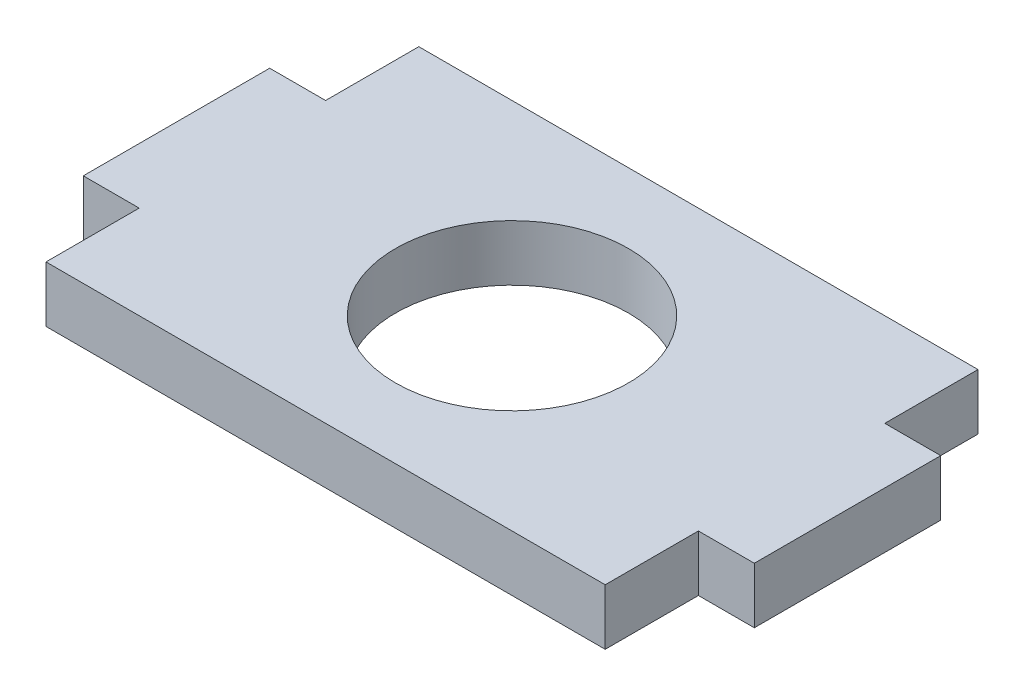
ISO-10303-21;
HEADER;
FILE_DESCRIPTION(('STEP AP214'),'2;1');
FILE_NAME('part.step','',(''),(''),'','','');
FILE_SCHEMA(('AUTOMOTIVE_DESIGN { 1 0 10303 214 1 1 1 1 }'));
ENDSEC;
DATA;
#1=APPLICATION_CONTEXT('core data for automotive mechanical design processes');
#2=APPLICATION_PROTOCOL_DEFINITION('international standard','automotive_design',2000,#1);
#3=PRODUCT_CONTEXT('',#1,'mechanical');
#4=PRODUCT('Part','Part','',(#3));
#5=PRODUCT_RELATED_PRODUCT_CATEGORY('part','',(#4));
#6=PRODUCT_DEFINITION_FORMATION('','',#4);
#7=PRODUCT_DEFINITION_CONTEXT('part definition',#1,'design');
#8=PRODUCT_DEFINITION('design','',#6,#7);
#9=PRODUCT_DEFINITION_SHAPE('','',#8);
#10=(LENGTH_UNIT() NAMED_UNIT(*) SI_UNIT(.MILLI.,.METRE.));
#11=(NAMED_UNIT(*) PLANE_ANGLE_UNIT() SI_UNIT($,.RADIAN.));
#12=(NAMED_UNIT(*) SI_UNIT($,.STERADIAN.) SOLID_ANGLE_UNIT());
#13=UNCERTAINTY_MEASURE_WITH_UNIT(LENGTH_MEASURE(1.E-05),#10,'distance_accuracy_value','');
#14=(GEOMETRIC_REPRESENTATION_CONTEXT(3) GLOBAL_UNCERTAINTY_ASSIGNED_CONTEXT((#13)) GLOBAL_UNIT_ASSIGNED_CONTEXT((#10,
#11,#12)) REPRESENTATION_CONTEXT('',''));
#15=CARTESIAN_POINT('',(0.,0.,0.));
#16=DIRECTION('',(0.,0.,1.));
#17=DIRECTION('',(1.,0.,0.));
#18=AXIS2_PLACEMENT_3D('',#15,#16,#17);
#19=CARTESIAN_POINT('',(0.,3.,0.));
#20=DIRECTION('',(0.,-1.,0.));
#21=DIRECTION('',(0.,0.,-1.));
#22=AXIS2_PLACEMENT_3D('',#19,#20,#21);
#23=PLANE('',#22);
#24=DIRECTION('',(0.,0.,1.));
#25=VECTOR('',#24,1.);
#26=CARTESIAN_POINT('',(-15.,3.,5.));
#27=LINE('',#26,#25);
#28=CARTESIAN_POINT('',(-15.,3.,5.));
#29=VERTEX_POINT('',#28);
#30=CARTESIAN_POINT('',(-15.,3.,10.));
#31=VERTEX_POINT('',#30);
#32=EDGE_CURVE('E177',#29,#31,#27,.T.);
#33=ORIENTED_EDGE('',*,*,#32,.T.);
#34=DIRECTION('',(1.,0.,0.));
#35=VECTOR('',#34,1.);
#36=CARTESIAN_POINT('',(15.,3.,10.));
#37=LINE('',#36,#35);
#38=CARTESIAN_POINT('',(15.,3.,10.));
#39=VERTEX_POINT('',#38);
#40=EDGE_CURVE('E105',#31,#39,#37,.T.);
#41=ORIENTED_EDGE('',*,*,#40,.T.);
#42=DIRECTION('',(0.,0.,-1.));
#43=VECTOR('',#42,1.);
#44=CARTESIAN_POINT('',(15.,3.,10.));
#45=LINE('',#44,#43);
#46=CARTESIAN_POINT('',(15.,3.,5.));
#47=VERTEX_POINT('',#46);
#48=EDGE_CURVE('E204',#39,#47,#45,.T.);
#49=ORIENTED_EDGE('',*,*,#48,.T.);
#50=DIRECTION('',(1.,0.,0.));
#51=VECTOR('',#50,1.);
#52=CARTESIAN_POINT('',(15.,3.,5.));
#53=LINE('',#52,#51);
#54=CARTESIAN_POINT('',(18.,3.,5.));
#55=VERTEX_POINT('',#54);
#56=EDGE_CURVE('E223',#47,#55,#53,.T.);
#57=ORIENTED_EDGE('',*,*,#56,.T.);
#58=DIRECTION('',(0.,0.,-1.));
#59=VECTOR('',#58,1.);
#60=CARTESIAN_POINT('',(18.,3.,5.));
#61=LINE('',#60,#59);
#62=CARTESIAN_POINT('',(18.,3.,-5.));
#63=VERTEX_POINT('',#62);
#64=EDGE_CURVE('E220',#55,#63,#61,.T.);
#65=ORIENTED_EDGE('',*,*,#64,.T.);
#66=DIRECTION('',(-1.,0.,0.));
#67=VECTOR('',#66,1.);
#68=CARTESIAN_POINT('',(18.,3.,-5.));
#69=LINE('',#68,#67);
#70=CARTESIAN_POINT('',(15.,3.,-5.));
#71=VERTEX_POINT('',#70);
#72=EDGE_CURVE('E222',#63,#71,#69,.T.);
#73=ORIENTED_EDGE('',*,*,#72,.T.);
#74=DIRECTION('',(0.,0.,-1.));
#75=VECTOR('',#74,1.);
#76=CARTESIAN_POINT('',(15.,3.,-5.));
#77=LINE('',#76,#75);
#78=CARTESIAN_POINT('',(15.,3.,-10.));
#79=VERTEX_POINT('',#78);
#80=EDGE_CURVE('E225',#71,#79,#77,.T.);
#81=ORIENTED_EDGE('',*,*,#80,.T.);
#82=DIRECTION('',(-1.,0.,0.));
#83=VECTOR('',#82,1.);
#84=CARTESIAN_POINT('',(15.,3.,-10.));
#85=LINE('',#84,#83);
#86=CARTESIAN_POINT('',(-15.,3.,-10.));
#87=VERTEX_POINT('',#86);
#88=EDGE_CURVE('E231',#79,#87,#85,.T.);
#89=ORIENTED_EDGE('',*,*,#88,.T.);
#90=DIRECTION('',(0.,0.,1.));
#91=VECTOR('',#90,1.);
#92=CARTESIAN_POINT('',(-15.,3.,-10.));
#93=LINE('',#92,#91);
#94=CARTESIAN_POINT('',(-15.,3.,-5.));
#95=VERTEX_POINT('',#94);
#96=EDGE_CURVE('E136',#87,#95,#93,.T.);
#97=ORIENTED_EDGE('',*,*,#96,.T.);
#98=DIRECTION('',(-1.,0.,0.));
#99=VECTOR('',#98,1.);
#100=CARTESIAN_POINT('',(-15.,3.,-5.));
#101=LINE('',#100,#99);
#102=CARTESIAN_POINT('',(-18.,3.,-5.));
#103=VERTEX_POINT('',#102);
#104=EDGE_CURVE('E130',#95,#103,#101,.T.);
#105=ORIENTED_EDGE('',*,*,#104,.T.);
#106=DIRECTION('',(0.,0.,1.));
#107=VECTOR('',#106,1.);
#108=CARTESIAN_POINT('',(-18.,3.,-5.));
#109=LINE('',#108,#107);
#110=CARTESIAN_POINT('',(-18.,3.,5.));
#111=VERTEX_POINT('',#110);
#112=EDGE_CURVE('E134',#103,#111,#109,.T.);
#113=ORIENTED_EDGE('',*,*,#112,.T.);
#114=DIRECTION('',(1.,0.,0.));
#115=VECTOR('',#114,1.);
#116=CARTESIAN_POINT('',(-18.,3.,5.));
#117=LINE('',#116,#115);
#118=EDGE_CURVE('E50',#111,#29,#117,.T.);
#119=ORIENTED_EDGE('',*,*,#118,.T.);
#120=EDGE_LOOP('',(#33,#41,#49,#57,#65,#73,#81,#89,#97,#105,#113,#119));
#121=FACE_BOUND('',#120,.T.);
#122=CARTESIAN_POINT('',(0.,3.,0.));
#123=DIRECTION('',(0.,1.,0.));
#124=DIRECTION('',(0.,0.,1.));
#125=AXIS2_PLACEMENT_3D('',#122,#123,#124);
#126=CIRCLE('',#125,6.25);
#127=CARTESIAN_POINT('',(0.,3.,6.25));
#128=VERTEX_POINT('',#127);
#129=EDGE_CURVE('E158',#128,#128,#126,.T.);
#130=ORIENTED_EDGE('',*,*,#129,.F.);
#131=EDGE_LOOP('',(#130));
#132=FACE_BOUND('',#131,.T.);
#133=ADVANCED_FACE('F33',(#121,#132),#23,.F.);
#134=CARTESIAN_POINT('',(0.,0.,0.));
#135=DIRECTION('',(0.,-1.,0.));
#136=DIRECTION('',(0.,0.,-1.));
#137=AXIS2_PLACEMENT_3D('',#134,#135,#136);
#138=PLANE('',#137);
#139=DIRECTION('',(0.,0.,1.));
#140=VECTOR('',#139,1.);
#141=CARTESIAN_POINT('',(-15.,0.,5.));
#142=LINE('',#141,#140);
#143=CARTESIAN_POINT('',(-15.,0.,5.));
#144=VERTEX_POINT('',#143);
#145=CARTESIAN_POINT('',(-15.,0.,10.));
#146=VERTEX_POINT('',#145);
#147=EDGE_CURVE('E154',#144,#146,#142,.T.);
#148=ORIENTED_EDGE('',*,*,#147,.F.);
#149=DIRECTION('',(1.,0.,0.));
#150=VECTOR('',#149,1.);
#151=CARTESIAN_POINT('',(-18.,0.,5.));
#152=LINE('',#151,#150);
#153=CARTESIAN_POINT('',(-18.,0.,5.));
#154=VERTEX_POINT('',#153);
#155=EDGE_CURVE('E97',#154,#144,#152,.T.);
#156=ORIENTED_EDGE('',*,*,#155,.F.);
#157=DIRECTION('',(0.,0.,1.));
#158=VECTOR('',#157,1.);
#159=CARTESIAN_POINT('',(-18.,0.,-5.));
#160=LINE('',#159,#158);
#161=CARTESIAN_POINT('',(-18.,0.,-5.));
#162=VERTEX_POINT('',#161);
#163=EDGE_CURVE('E91',#162,#154,#160,.T.);
#164=ORIENTED_EDGE('',*,*,#163,.F.);
#165=DIRECTION('',(-1.,0.,0.));
#166=VECTOR('',#165,1.);
#167=CARTESIAN_POINT('',(-15.,0.,-5.));
#168=LINE('',#167,#166);
#169=CARTESIAN_POINT('',(-15.,0.,-5.));
#170=VERTEX_POINT('',#169);
#171=EDGE_CURVE('E144',#170,#162,#168,.T.);
#172=ORIENTED_EDGE('',*,*,#171,.F.);
#173=DIRECTION('',(0.,0.,1.));
#174=VECTOR('',#173,1.);
#175=CARTESIAN_POINT('',(-15.,0.,-10.));
#176=LINE('',#175,#174);
#177=CARTESIAN_POINT('',(-15.,0.,-10.));
#178=VERTEX_POINT('',#177);
#179=EDGE_CURVE('E172',#178,#170,#176,.T.);
#180=ORIENTED_EDGE('',*,*,#179,.F.);
#181=DIRECTION('',(-1.,0.,0.));
#182=VECTOR('',#181,1.);
#183=CARTESIAN_POINT('',(15.,0.,-10.));
#184=LINE('',#183,#182);
#185=CARTESIAN_POINT('',(15.,0.,-10.));
#186=VERTEX_POINT('',#185);
#187=EDGE_CURVE('E170',#186,#178,#184,.T.);
#188=ORIENTED_EDGE('',*,*,#187,.F.);
#189=DIRECTION('',(0.,0.,-1.));
#190=VECTOR('',#189,1.);
#191=CARTESIAN_POINT('',(15.,0.,-5.));
#192=LINE('',#191,#190);
#193=CARTESIAN_POINT('',(15.,0.,-5.));
#194=VERTEX_POINT('',#193);
#195=EDGE_CURVE('E168',#194,#186,#192,.T.);
#196=ORIENTED_EDGE('',*,*,#195,.F.);
#197=DIRECTION('',(-1.,0.,0.));
#198=VECTOR('',#197,1.);
#199=CARTESIAN_POINT('',(18.,0.,-5.));
#200=LINE('',#199,#198);
#201=CARTESIAN_POINT('',(18.,0.,-5.));
#202=VERTEX_POINT('',#201);
#203=EDGE_CURVE('E166',#202,#194,#200,.T.);
#204=ORIENTED_EDGE('',*,*,#203,.F.);
#205=DIRECTION('',(0.,0.,-1.));
#206=VECTOR('',#205,1.);
#207=CARTESIAN_POINT('',(18.,0.,5.));
#208=LINE('',#207,#206);
#209=CARTESIAN_POINT('',(18.,0.,5.));
#210=VERTEX_POINT('',#209);
#211=EDGE_CURVE('E164',#210,#202,#208,.T.);
#212=ORIENTED_EDGE('',*,*,#211,.F.);
#213=DIRECTION('',(1.,0.,0.));
#214=VECTOR('',#213,1.);
#215=CARTESIAN_POINT('',(15.,0.,5.));
#216=LINE('',#215,#214);
#217=CARTESIAN_POINT('',(15.,0.,5.));
#218=VERTEX_POINT('',#217);
#219=EDGE_CURVE('E162',#218,#210,#216,.T.);
#220=ORIENTED_EDGE('',*,*,#219,.F.);
#221=DIRECTION('',(0.,0.,-1.));
#222=VECTOR('',#221,1.);
#223=CARTESIAN_POINT('',(15.,0.,10.));
#224=LINE('',#223,#222);
#225=CARTESIAN_POINT('',(15.,0.,10.));
#226=VERTEX_POINT('',#225);
#227=EDGE_CURVE('E160',#226,#218,#224,.T.);
#228=ORIENTED_EDGE('',*,*,#227,.F.);
#229=DIRECTION('',(1.,0.,0.));
#230=VECTOR('',#229,1.);
#231=CARTESIAN_POINT('',(15.,0.,10.));
#232=LINE('',#231,#230);
#233=EDGE_CURVE('E157',#146,#226,#232,.T.);
#234=ORIENTED_EDGE('',*,*,#233,.F.);
#235=EDGE_LOOP('',(#148,#156,#164,#172,#180,#188,#196,#204,#212,#220,#228,#234));
#236=FACE_BOUND('',#235,.T.);
#237=CARTESIAN_POINT('',(0.,0.,0.));
#238=DIRECTION('',(0.,1.,0.));
#239=DIRECTION('',(0.,0.,1.));
#240=AXIS2_PLACEMENT_3D('',#237,#238,#239);
#241=CIRCLE('',#240,6.25);
#242=CARTESIAN_POINT('',(0.,0.,6.25));
#243=VERTEX_POINT('',#242);
#244=EDGE_CURVE('E378',#243,#243,#241,.T.);
#245=ORIENTED_EDGE('',*,*,#244,.T.);
#246=EDGE_LOOP('',(#245));
#247=FACE_BOUND('',#246,.T.);
#248=ADVANCED_FACE('F208',(#236,#247),#138,.T.);
#249=CARTESIAN_POINT('',(-15.,3.,5.));
#250=DIRECTION('',(1.,0.,0.));
#251=DIRECTION('',(0.,0.,-1.));
#252=AXIS2_PLACEMENT_3D('',#249,#250,#251);
#253=PLANE('',#252);
#254=ORIENTED_EDGE('',*,*,#147,.T.);
#255=DIRECTION('',(0.,-1.,0.));
#256=VECTOR('',#255,1.);
#257=CARTESIAN_POINT('',(-15.,3.,10.));
#258=LINE('',#257,#256);
#259=EDGE_CURVE('E11',#31,#146,#258,.T.);
#260=ORIENTED_EDGE('',*,*,#259,.F.);
#261=ORIENTED_EDGE('',*,*,#32,.F.);
#262=DIRECTION('',(0.,-1.,0.));
#263=VECTOR('',#262,1.);
#264=CARTESIAN_POINT('',(-15.,3.,5.));
#265=LINE('',#264,#263);
#266=EDGE_CURVE('E150',#29,#144,#265,.T.);
#267=ORIENTED_EDGE('',*,*,#266,.T.);
#268=EDGE_LOOP('',(#254,#260,#261,#267));
#269=FACE_BOUND('',#268,.T.);
#270=ADVANCED_FACE('F35',(#269),#253,.F.);
#271=CARTESIAN_POINT('',(15.,3.,10.));
#272=DIRECTION('',(0.,0.,-1.));
#273=DIRECTION('',(-1.,0.,0.));
#274=AXIS2_PLACEMENT_3D('',#271,#272,#273);
#275=PLANE('',#274);
#276=ORIENTED_EDGE('',*,*,#233,.T.);
#277=DIRECTION('',(0.,-1.,0.));
#278=VECTOR('',#277,1.);
#279=CARTESIAN_POINT('',(15.,3.,10.));
#280=LINE('',#279,#278);
#281=EDGE_CURVE('E42',#39,#226,#280,.T.);
#282=ORIENTED_EDGE('',*,*,#281,.F.);
#283=ORIENTED_EDGE('',*,*,#40,.F.);
#284=ORIENTED_EDGE('',*,*,#259,.T.);
#285=EDGE_LOOP('',(#276,#282,#283,#284));
#286=FACE_BOUND('',#285,.T.);
#287=ADVANCED_FACE('F265',(#286),#275,.F.);
#288=CARTESIAN_POINT('',(15.,3.,10.));
#289=DIRECTION('',(-1.,0.,0.));
#290=DIRECTION('',(0.,0.,1.));
#291=AXIS2_PLACEMENT_3D('',#288,#289,#290);
#292=PLANE('',#291);
#293=ORIENTED_EDGE('',*,*,#227,.T.);
#294=DIRECTION('',(0.,-1.,0.));
#295=VECTOR('',#294,1.);
#296=CARTESIAN_POINT('',(15.,3.,5.));
#297=LINE('',#296,#295);
#298=EDGE_CURVE('E196',#47,#218,#297,.T.);
#299=ORIENTED_EDGE('',*,*,#298,.F.);
#300=ORIENTED_EDGE('',*,*,#48,.F.);
#301=ORIENTED_EDGE('',*,*,#281,.T.);
#302=EDGE_LOOP('',(#293,#299,#300,#301));
#303=FACE_BOUND('',#302,.T.);
#304=ADVANCED_FACE('F202',(#303),#292,.F.);
#305=CARTESIAN_POINT('',(15.,3.,5.));
#306=DIRECTION('',(0.,0.,-1.));
#307=DIRECTION('',(-1.,0.,0.));
#308=AXIS2_PLACEMENT_3D('',#305,#306,#307);
#309=PLANE('',#308);
#310=ORIENTED_EDGE('',*,*,#219,.T.);
#311=DIRECTION('',(0.,-1.,0.));
#312=VECTOR('',#311,1.);
#313=CARTESIAN_POINT('',(18.,3.,5.));
#314=LINE('',#313,#312);
#315=EDGE_CURVE('E193',#55,#210,#314,.T.);
#316=ORIENTED_EDGE('',*,*,#315,.F.);
#317=ORIENTED_EDGE('',*,*,#56,.F.);
#318=ORIENTED_EDGE('',*,*,#298,.T.);
#319=EDGE_LOOP('',(#310,#316,#317,#318));
#320=FACE_BOUND('',#319,.T.);
#321=ADVANCED_FACE('F214',(#320),#309,.F.);
#322=CARTESIAN_POINT('',(18.,3.,5.));
#323=DIRECTION('',(-1.,0.,0.));
#324=DIRECTION('',(0.,0.,1.));
#325=AXIS2_PLACEMENT_3D('',#322,#323,#324);
#326=PLANE('',#325);
#327=ORIENTED_EDGE('',*,*,#211,.T.);
#328=DIRECTION('',(0.,-1.,0.));
#329=VECTOR('',#328,1.);
#330=CARTESIAN_POINT('',(18.,3.,-5.));
#331=LINE('',#330,#329);
#332=EDGE_CURVE('E190',#63,#202,#331,.T.);
#333=ORIENTED_EDGE('',*,*,#332,.F.);
#334=ORIENTED_EDGE('',*,*,#64,.F.);
#335=ORIENTED_EDGE('',*,*,#315,.T.);
#336=EDGE_LOOP('',(#327,#333,#334,#335));
#337=FACE_BOUND('',#336,.T.);
#338=ADVANCED_FACE('F218',(#337),#326,.F.);
#339=CARTESIAN_POINT('',(18.,3.,-5.));
#340=DIRECTION('',(0.,0.,1.));
#341=DIRECTION('',(1.,0.,0.));
#342=AXIS2_PLACEMENT_3D('',#339,#340,#341);
#343=PLANE('',#342);
#344=ORIENTED_EDGE('',*,*,#203,.T.);
#345=DIRECTION('',(0.,-1.,0.));
#346=VECTOR('',#345,1.);
#347=CARTESIAN_POINT('',(15.,3.,-5.));
#348=LINE('',#347,#346);
#349=EDGE_CURVE('E187',#71,#194,#348,.T.);
#350=ORIENTED_EDGE('',*,*,#349,.F.);
#351=ORIENTED_EDGE('',*,*,#72,.F.);
#352=ORIENTED_EDGE('',*,*,#332,.T.);
#353=EDGE_LOOP('',(#344,#350,#351,#352));
#354=FACE_BOUND('',#353,.T.);
#355=ADVANCED_FACE('F278',(#354),#343,.F.);
#356=CARTESIAN_POINT('',(15.,3.,-5.));
#357=DIRECTION('',(-1.,0.,0.));
#358=DIRECTION('',(0.,0.,1.));
#359=AXIS2_PLACEMENT_3D('',#356,#357,#358);
#360=PLANE('',#359);
#361=ORIENTED_EDGE('',*,*,#195,.T.);
#362=DIRECTION('',(0.,-1.,0.));
#363=VECTOR('',#362,1.);
#364=CARTESIAN_POINT('',(15.,3.,-10.));
#365=LINE('',#364,#363);
#366=EDGE_CURVE('E184',#79,#186,#365,.T.);
#367=ORIENTED_EDGE('',*,*,#366,.F.);
#368=ORIENTED_EDGE('',*,*,#80,.F.);
#369=ORIENTED_EDGE('',*,*,#349,.T.);
#370=EDGE_LOOP('',(#361,#367,#368,#369));
#371=FACE_BOUND('',#370,.T.);
#372=ADVANCED_FACE('F281',(#371),#360,.F.);
#373=CARTESIAN_POINT('',(15.,3.,-10.));
#374=DIRECTION('',(0.,0.,1.));
#375=DIRECTION('',(1.,0.,0.));
#376=AXIS2_PLACEMENT_3D('',#373,#374,#375);
#377=PLANE('',#376);
#378=ORIENTED_EDGE('',*,*,#187,.T.);
#379=DIRECTION('',(0.,-1.,0.));
#380=VECTOR('',#379,1.);
#381=CARTESIAN_POINT('',(-15.,3.,-10.));
#382=LINE('',#381,#380);
#383=EDGE_CURVE('E181',#87,#178,#382,.T.);
#384=ORIENTED_EDGE('',*,*,#383,.F.);
#385=ORIENTED_EDGE('',*,*,#88,.F.);
#386=ORIENTED_EDGE('',*,*,#366,.T.);
#387=EDGE_LOOP('',(#378,#384,#385,#386));
#388=FACE_BOUND('',#387,.T.);
#389=ADVANCED_FACE('F237',(#388),#377,.F.);
#390=CARTESIAN_POINT('',(-15.,3.,-10.));
#391=DIRECTION('',(1.,0.,0.));
#392=DIRECTION('',(0.,0.,-1.));
#393=AXIS2_PLACEMENT_3D('',#390,#391,#392);
#394=PLANE('',#393);
#395=ORIENTED_EDGE('',*,*,#179,.T.);
#396=DIRECTION('',(0.,-1.,0.));
#397=VECTOR('',#396,1.);
#398=CARTESIAN_POINT('',(-15.,3.,-5.));
#399=LINE('',#398,#397);
#400=EDGE_CURVE('E145',#95,#170,#399,.T.);
#401=ORIENTED_EDGE('',*,*,#400,.F.);
#402=ORIENTED_EDGE('',*,*,#96,.F.);
#403=ORIENTED_EDGE('',*,*,#383,.T.);
#404=EDGE_LOOP('',(#395,#401,#402,#403));
#405=FACE_BOUND('',#404,.T.);
#406=ADVANCED_FACE('F241',(#405),#394,.F.);
#407=CARTESIAN_POINT('',(-15.,3.,-5.));
#408=DIRECTION('',(0.,0.,1.));
#409=DIRECTION('',(1.,0.,0.));
#410=AXIS2_PLACEMENT_3D('',#407,#408,#409);
#411=PLANE('',#410);
#412=ORIENTED_EDGE('',*,*,#171,.T.);
#413=DIRECTION('',(0.,-1.,0.));
#414=VECTOR('',#413,1.);
#415=CARTESIAN_POINT('',(-18.,3.,-5.));
#416=LINE('',#415,#414);
#417=EDGE_CURVE('E141',#103,#162,#416,.T.);
#418=ORIENTED_EDGE('',*,*,#417,.F.);
#419=ORIENTED_EDGE('',*,*,#104,.F.);
#420=ORIENTED_EDGE('',*,*,#400,.T.);
#421=EDGE_LOOP('',(#412,#418,#419,#420));
#422=FACE_BOUND('',#421,.T.);
#423=ADVANCED_FACE('F142',(#422),#411,.F.);
#424=CARTESIAN_POINT('',(-18.,3.,-5.));
#425=DIRECTION('',(1.,0.,0.));
#426=DIRECTION('',(0.,0.,-1.));
#427=AXIS2_PLACEMENT_3D('',#424,#425,#426);
#428=PLANE('',#427);
#429=ORIENTED_EDGE('',*,*,#163,.T.);
#430=DIRECTION('',(0.,-1.,0.));
#431=VECTOR('',#430,1.);
#432=CARTESIAN_POINT('',(-18.,3.,5.));
#433=LINE('',#432,#431);
#434=EDGE_CURVE('E146',#111,#154,#433,.T.);
#435=ORIENTED_EDGE('',*,*,#434,.F.);
#436=ORIENTED_EDGE('',*,*,#112,.F.);
#437=ORIENTED_EDGE('',*,*,#417,.T.);
#438=EDGE_LOOP('',(#429,#435,#436,#437));
#439=FACE_BOUND('',#438,.T.);
#440=ADVANCED_FACE('F148',(#439),#428,.F.);
#441=CARTESIAN_POINT('',(-18.,3.,5.));
#442=DIRECTION('',(0.,0.,-1.));
#443=DIRECTION('',(-1.,0.,0.));
#444=AXIS2_PLACEMENT_3D('',#441,#442,#443);
#445=PLANE('',#444);
#446=ORIENTED_EDGE('',*,*,#155,.T.);
#447=ORIENTED_EDGE('',*,*,#266,.F.);
#448=ORIENTED_EDGE('',*,*,#118,.F.);
#449=ORIENTED_EDGE('',*,*,#434,.T.);
#450=EDGE_LOOP('',(#446,#447,#448,#449));
#451=FACE_BOUND('',#450,.T.);
#452=ADVANCED_FACE('F245',(#451),#445,.F.);
#453=CARTESIAN_POINT('',(0.,3.,0.));
#454=DIRECTION('',(0.,-1.,0.));
#455=DIRECTION('',(0.,0.,-1.));
#456=AXIS2_PLACEMENT_3D('',#453,#454,#455);
#457=CYLINDRICAL_SURFACE('',#456,6.25);
#458=ORIENTED_EDGE('',*,*,#129,.T.);
#459=EDGE_LOOP('',(#458));
#460=FACE_BOUND('',#459,.T.);
#461=ORIENTED_EDGE('',*,*,#244,.F.);
#462=EDGE_LOOP('',(#461));
#463=FACE_BOUND('',#462,.T.);
#464=ADVANCED_FACE('F247',(#460,#463),#457,.F.);
#465=CLOSED_SHELL('',(#133,#248,#270,#287,#304,#321,#338,#355,#372,#389,#406,#423,#440,#452,#464));
#466=MANIFOLD_SOLID_BREP('B2',#465);
#467=ADVANCED_BREP_SHAPE_REPRESENTATION('',(#18,#466),#14);
#468=SHAPE_DEFINITION_REPRESENTATION(#9,#467);
ENDSEC;
END-ISO-10303-21;
